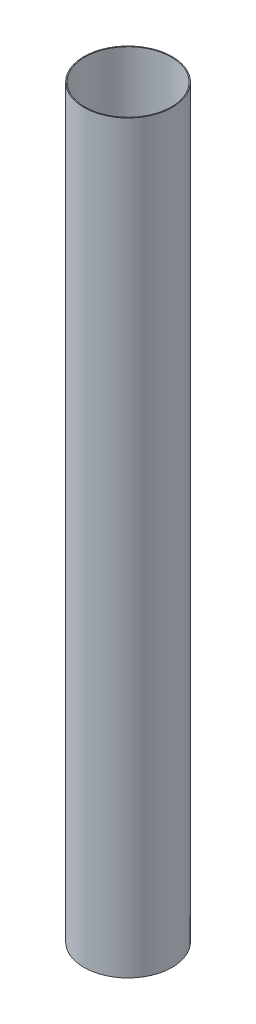
ISO-10303-21;
HEADER;
FILE_DESCRIPTION(('STEP AP214'),'2;1');
FILE_NAME('part.step','',(''),(''),'','','');
FILE_SCHEMA(('AUTOMOTIVE_DESIGN { 1 0 10303 214 1 1 1 1 }'));
ENDSEC;
DATA;
#1=APPLICATION_CONTEXT('core data for automotive mechanical design processes');
#2=APPLICATION_PROTOCOL_DEFINITION('international standard','automotive_design',2000,#1);
#3=PRODUCT_CONTEXT('',#1,'mechanical');
#4=PRODUCT('Part','Part','',(#3));
#5=PRODUCT_RELATED_PRODUCT_CATEGORY('part','',(#4));
#6=PRODUCT_DEFINITION_FORMATION('','',#4);
#7=PRODUCT_DEFINITION_CONTEXT('part definition',#1,'design');
#8=PRODUCT_DEFINITION('design','',#6,#7);
#9=PRODUCT_DEFINITION_SHAPE('','',#8);
#10=(LENGTH_UNIT() NAMED_UNIT(*) SI_UNIT(.MILLI.,.METRE.));
#11=(NAMED_UNIT(*) PLANE_ANGLE_UNIT() SI_UNIT($,.RADIAN.));
#12=(NAMED_UNIT(*) SI_UNIT($,.STERADIAN.) SOLID_ANGLE_UNIT());
#13=UNCERTAINTY_MEASURE_WITH_UNIT(LENGTH_MEASURE(1.E-05),#10,'distance_accuracy_value','');
#14=(GEOMETRIC_REPRESENTATION_CONTEXT(3) GLOBAL_UNCERTAINTY_ASSIGNED_CONTEXT((#13)) GLOBAL_UNIT_ASSIGNED_CONTEXT((#10,
#11,#12)) REPRESENTATION_CONTEXT('',''));
#15=CARTESIAN_POINT('',(0.,0.,0.));
#16=DIRECTION('',(0.,0.,1.));
#17=DIRECTION('',(1.,0.,0.));
#18=AXIS2_PLACEMENT_3D('',#15,#16,#17);
#19=CARTESIAN_POINT('',(0.,874.5982,0.));
#20=DIRECTION('',(0.,-1.,0.));
#21=DIRECTION('',(0.,0.,-1.));
#22=AXIS2_PLACEMENT_3D('',#19,#20,#21);
#23=CYLINDRICAL_SURFACE('',#22,50.8);
#24=CARTESIAN_POINT('',(0.,0.,0.));
#25=DIRECTION('',(0.,-1.,0.));
#26=DIRECTION('',(0.,0.,-1.));
#27=AXIS2_PLACEMENT_3D('',#24,#25,#26);
#28=CIRCLE('',#27,50.8);
#29=CARTESIAN_POINT('',(0.,0.,-50.8));
#30=VERTEX_POINT('',#29);
#31=EDGE_CURVE('E25',#30,#30,#28,.T.);
#32=ORIENTED_EDGE('',*,*,#31,.T.);
#33=EDGE_LOOP('',(#32));
#34=FACE_BOUND('',#33,.T.);
#35=CARTESIAN_POINT('',(0.,874.5982,0.));
#36=DIRECTION('',(0.,-1.,0.));
#37=DIRECTION('',(0.,0.,-1.));
#38=AXIS2_PLACEMENT_3D('',#35,#36,#37);
#39=CIRCLE('',#38,50.8);
#40=CARTESIAN_POINT('',(0.,874.5982,-50.8));
#41=VERTEX_POINT('',#40);
#42=EDGE_CURVE('E16',#41,#41,#39,.T.);
#43=ORIENTED_EDGE('',*,*,#42,.F.);
#44=EDGE_LOOP('',(#43));
#45=FACE_BOUND('',#44,.T.);
#46=ADVANCED_FACE('F13',(#34,#45),#23,.F.);
#47=CARTESIAN_POINT('',(0.,874.5982,0.));
#48=DIRECTION('',(0.,1.,0.));
#49=DIRECTION('',(0.,0.,1.));
#50=AXIS2_PLACEMENT_3D('',#47,#48,#49);
#51=PLANE('',#50);
#52=ORIENTED_EDGE('',*,*,#42,.T.);
#53=EDGE_LOOP('',(#52));
#54=FACE_BOUND('',#53,.T.);
#55=CARTESIAN_POINT('',(0.,874.5982,0.));
#56=DIRECTION('',(0.,-1.,0.));
#57=DIRECTION('',(0.,0.,-1.));
#58=AXIS2_PLACEMENT_3D('',#55,#56,#57);
#59=CIRCLE('',#58,51.816);
#60=CARTESIAN_POINT('',(0.,874.5982,-51.816));
#61=VERTEX_POINT('',#60);
#62=EDGE_CURVE('E20',#61,#61,#59,.T.);
#63=ORIENTED_EDGE('',*,*,#62,.F.);
#64=EDGE_LOOP('',(#63));
#65=FACE_BOUND('',#64,.T.);
#66=ADVANCED_FACE('F33',(#54,#65),#51,.T.);
#67=CARTESIAN_POINT('',(0.,0.,0.));
#68=DIRECTION('',(0.,1.,0.));
#69=DIRECTION('',(0.,0.,1.));
#70=AXIS2_PLACEMENT_3D('',#67,#68,#69);
#71=PLANE('',#70);
#72=ORIENTED_EDGE('',*,*,#31,.F.);
#73=EDGE_LOOP('',(#72));
#74=FACE_BOUND('',#73,.T.);
#75=CARTESIAN_POINT('',(0.,0.,0.));
#76=DIRECTION('',(0.,-1.,0.));
#77=DIRECTION('',(0.,0.,-1.));
#78=AXIS2_PLACEMENT_3D('',#75,#76,#77);
#79=CIRCLE('',#78,51.816);
#80=CARTESIAN_POINT('',(0.,0.,-51.816));
#81=VERTEX_POINT('',#80);
#82=EDGE_CURVE('E9',#81,#81,#79,.F.);
#83=ORIENTED_EDGE('',*,*,#82,.F.);
#84=EDGE_LOOP('',(#83));
#85=FACE_BOUND('',#84,.T.);
#86=ADVANCED_FACE('F41',(#74,#85),#71,.F.);
#87=CARTESIAN_POINT('',(0.,874.5982,0.));
#88=DIRECTION('',(0.,-1.,0.));
#89=DIRECTION('',(0.,0.,-1.));
#90=AXIS2_PLACEMENT_3D('',#87,#88,#89);
#91=CYLINDRICAL_SURFACE('',#90,51.816);
#92=ORIENTED_EDGE('',*,*,#82,.T.);
#93=EDGE_LOOP('',(#92));
#94=FACE_BOUND('',#93,.T.);
#95=ORIENTED_EDGE('',*,*,#62,.T.);
#96=EDGE_LOOP('',(#95));
#97=FACE_BOUND('',#96,.T.);
#98=ADVANCED_FACE('F42',(#94,#97),#91,.T.);
#99=CLOSED_SHELL('',(#46,#66,#86,#98));
#100=MANIFOLD_SOLID_BREP('B1',#99);
#101=ADVANCED_BREP_SHAPE_REPRESENTATION('',(#18,#100),#14);
#102=SHAPE_DEFINITION_REPRESENTATION(#9,#101);
ENDSEC;
END-ISO-10303-21;
